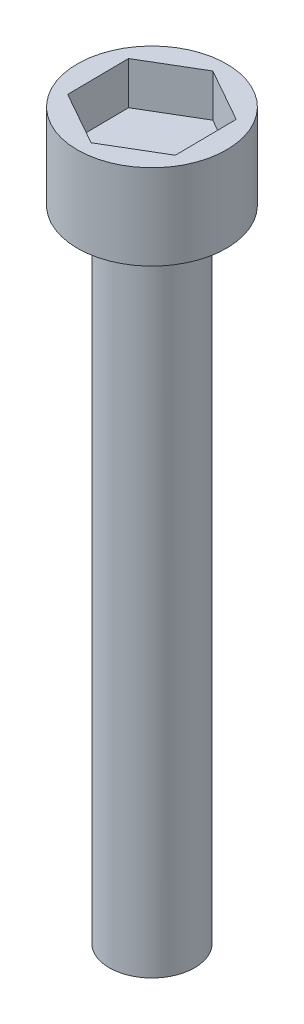
ISO-10303-21;
HEADER;
FILE_DESCRIPTION(('STEP AP214'),'2;1');
FILE_NAME('part.step','',(''),(''),'','','');
FILE_SCHEMA(('AUTOMOTIVE_DESIGN { 1 0 10303 214 1 1 1 1 }'));
ENDSEC;
DATA;
#1=APPLICATION_CONTEXT('core data for automotive mechanical design processes');
#2=APPLICATION_PROTOCOL_DEFINITION('international standard','automotive_design',2000,#1);
#3=PRODUCT_CONTEXT('',#1,'mechanical');
#4=PRODUCT('Part','Part','',(#3));
#5=PRODUCT_RELATED_PRODUCT_CATEGORY('part','',(#4));
#6=PRODUCT_DEFINITION_FORMATION('','',#4);
#7=PRODUCT_DEFINITION_CONTEXT('part definition',#1,'design');
#8=PRODUCT_DEFINITION('design','',#6,#7);
#9=PRODUCT_DEFINITION_SHAPE('','',#8);
#10=(LENGTH_UNIT() NAMED_UNIT(*) SI_UNIT(.MILLI.,.METRE.));
#11=(NAMED_UNIT(*) PLANE_ANGLE_UNIT() SI_UNIT($,.RADIAN.));
#12=(NAMED_UNIT(*) SI_UNIT($,.STERADIAN.) SOLID_ANGLE_UNIT());
#13=UNCERTAINTY_MEASURE_WITH_UNIT(LENGTH_MEASURE(1.E-05),#10,'distance_accuracy_value','');
#14=(GEOMETRIC_REPRESENTATION_CONTEXT(3) GLOBAL_UNCERTAINTY_ASSIGNED_CONTEXT((#13)) GLOBAL_UNIT_ASSIGNED_CONTEXT((#10,
#11,#12)) REPRESENTATION_CONTEXT('',''));
#15=CARTESIAN_POINT('',(0.,0.,0.));
#16=DIRECTION('',(0.,0.,1.));
#17=DIRECTION('',(1.,0.,0.));
#18=AXIS2_PLACEMENT_3D('',#15,#16,#17);
#19=CARTESIAN_POINT('',(0.,-4.,0.));
#20=DIRECTION('',(0.,1.,0.));
#21=DIRECTION('',(0.,0.,1.));
#22=AXIS2_PLACEMENT_3D('',#19,#20,#21);
#23=CYLINDRICAL_SURFACE('',#22,3.5);
#24=CARTESIAN_POINT('',(0.,-4.,0.));
#25=DIRECTION('',(0.,1.,0.));
#26=DIRECTION('',(0.,0.,1.));
#27=AXIS2_PLACEMENT_3D('',#24,#25,#26);
#28=CIRCLE('',#27,3.5);
#29=CARTESIAN_POINT('',(0.,-4.,3.5));
#30=VERTEX_POINT('',#29);
#31=EDGE_CURVE('E41',#30,#30,#28,.T.);
#32=ORIENTED_EDGE('',*,*,#31,.T.);
#33=EDGE_LOOP('',(#32));
#34=FACE_BOUND('',#33,.T.);
#35=CARTESIAN_POINT('',(0.,0.,0.));
#36=DIRECTION('',(0.,1.,0.));
#37=DIRECTION('',(0.,0.,1.));
#38=AXIS2_PLACEMENT_3D('',#35,#36,#37);
#39=CIRCLE('',#38,3.5);
#40=CARTESIAN_POINT('',(0.,0.,3.5));
#41=VERTEX_POINT('',#40);
#42=EDGE_CURVE('E143',#41,#41,#39,.T.);
#43=ORIENTED_EDGE('',*,*,#42,.F.);
#44=EDGE_LOOP('',(#43));
#45=FACE_BOUND('',#44,.T.);
#46=ADVANCED_FACE('F34',(#34,#45),#23,.T.);
#47=CARTESIAN_POINT('',(0.,-4.,0.));
#48=DIRECTION('',(0.,1.,0.));
#49=DIRECTION('',(0.,0.,1.));
#50=AXIS2_PLACEMENT_3D('',#47,#48,#49);
#51=PLANE('',#50);
#52=CARTESIAN_POINT('',(0.,-4.,0.));
#53=DIRECTION('',(0.,1.,0.));
#54=DIRECTION('',(0.,0.,1.));
#55=AXIS2_PLACEMENT_3D('',#52,#53,#54);
#56=CIRCLE('',#55,2.);
#57=CARTESIAN_POINT('',(0.,-4.,2.));
#58=VERTEX_POINT('',#57);
#59=EDGE_CURVE('E11',#58,#58,#56,.F.);
#60=ORIENTED_EDGE('',*,*,#59,.F.);
#61=EDGE_LOOP('',(#60));
#62=FACE_BOUND('',#61,.T.);
#63=ORIENTED_EDGE('',*,*,#31,.F.);
#64=EDGE_LOOP('',(#63));
#65=FACE_BOUND('',#64,.T.);
#66=ADVANCED_FACE('F151',(#62,#65),#51,.F.);
#67=CARTESIAN_POINT('',(0.,0.,0.));
#68=DIRECTION('',(0.,1.,0.));
#69=DIRECTION('',(0.,0.,1.));
#70=AXIS2_PLACEMENT_3D('',#67,#68,#69);
#71=PLANE('',#70);
#72=DIRECTION('',(-0.0108771505972784,0.,-0.99994084204761));
#73=VECTOR('',#72,1.);
#74=CARTESIAN_POINT('',(2.51555191968241,0.,1.41609740933153));
#75=LINE('',#74,#73);
#76=CARTESIAN_POINT('',(2.51555191968241,0.,1.41609740933153));
#77=VERTEX_POINT('',#76);
#78=CARTESIAN_POINT('',(2.48415229055564,0.,-1.47048316231792));
#79=VERTEX_POINT('',#78);
#80=EDGE_CURVE('E48',#77,#79,#75,.T.);
#81=ORIENTED_EDGE('',*,*,#80,.F.);
#82=DIRECTION('',(0.860535596196194,0.,-0.509390309761838));
#83=VECTOR('',#82,1.);
#84=CARTESIAN_POINT('',(0.031399629126774,0.,2.88658057164945));
#85=LINE('',#84,#83);
#86=CARTESIAN_POINT('',(0.031399629126774,0.,2.88658057164945));
#87=VERTEX_POINT('',#86);
#88=EDGE_CURVE('E131',#87,#77,#85,.T.);
#89=ORIENTED_EDGE('',*,*,#88,.F.);
#90=DIRECTION('',(0.871412746793473,0.,0.490550532285773));
#91=VECTOR('',#90,1.);
#92=CARTESIAN_POINT('',(-2.48415229055564,0.,1.47048316231792));
#93=LINE('',#92,#91);
#94=CARTESIAN_POINT('',(-2.48415229055564,0.,1.47048316231792));
#95=VERTEX_POINT('',#94);
#96=EDGE_CURVE('E129',#95,#87,#93,.T.);
#97=ORIENTED_EDGE('',*,*,#96,.F.);
#98=DIRECTION('',(0.0108771505972782,0.,0.99994084204761));
#99=VECTOR('',#98,1.);
#100=CARTESIAN_POINT('',(-2.51555191968241,0.,-1.41609740933153));
#101=LINE('',#100,#99);
#102=CARTESIAN_POINT('',(-2.51555191968241,0.,-1.41609740933153));
#103=VERTEX_POINT('',#102);
#104=EDGE_CURVE('E96',#103,#95,#101,.T.);
#105=ORIENTED_EDGE('',*,*,#104,.F.);
#106=DIRECTION('',(-0.860535596196194,0.,0.509390309761837));
#107=VECTOR('',#106,1.);
#108=CARTESIAN_POINT('',(-0.031399629126774,0.,-2.88658057164945));
#109=LINE('',#108,#107);
#110=CARTESIAN_POINT('',(-0.031399629126774,0.,-2.88658057164945));
#111=VERTEX_POINT('',#110);
#112=EDGE_CURVE('E125',#111,#103,#109,.T.);
#113=ORIENTED_EDGE('',*,*,#112,.F.);
#114=DIRECTION('',(-0.871412746793473,0.,-0.490550532285773));
#115=VECTOR('',#114,1.);
#116=CARTESIAN_POINT('',(2.48415229055564,0.,-1.47048316231792));
#117=LINE('',#116,#115);
#118=EDGE_CURVE('E122',#79,#111,#117,.T.);
#119=ORIENTED_EDGE('',*,*,#118,.F.);
#120=EDGE_LOOP('',(#81,#89,#97,#105,#113,#119));
#121=FACE_BOUND('',#120,.T.);
#122=ORIENTED_EDGE('',*,*,#42,.T.);
#123=EDGE_LOOP('',(#122));
#124=FACE_BOUND('',#123,.T.);
#125=ADVANCED_FACE('F148',(#121,#124),#71,.T.);
#126=CARTESIAN_POINT('',(0.,-34.,0.));
#127=DIRECTION('',(0.,1.,0.));
#128=DIRECTION('',(0.,0.,1.));
#129=AXIS2_PLACEMENT_3D('',#126,#127,#128);
#130=CYLINDRICAL_SURFACE('',#129,2.);
#131=CARTESIAN_POINT('',(0.,-34.,0.));
#132=DIRECTION('',(0.,-1.,0.));
#133=DIRECTION('',(0.,0.,-1.));
#134=AXIS2_PLACEMENT_3D('',#131,#132,#133);
#135=CIRCLE('',#134,2.);
#136=CARTESIAN_POINT('',(0.,-34.,-2.));
#137=VERTEX_POINT('',#136);
#138=EDGE_CURVE('E135',#137,#137,#135,.T.);
#139=ORIENTED_EDGE('',*,*,#138,.F.);
#140=EDGE_LOOP('',(#139));
#141=FACE_BOUND('',#140,.T.);
#142=ORIENTED_EDGE('',*,*,#59,.T.);
#143=EDGE_LOOP('',(#142));
#144=FACE_BOUND('',#143,.T.);
#145=ADVANCED_FACE('F163',(#141,#144),#130,.T.);
#146=CARTESIAN_POINT('',(0.,-34.,0.));
#147=DIRECTION('',(0.,-1.,0.));
#148=DIRECTION('',(0.,0.,-1.));
#149=AXIS2_PLACEMENT_3D('',#146,#147,#148);
#150=PLANE('',#149);
#151=ORIENTED_EDGE('',*,*,#138,.T.);
#152=EDGE_LOOP('',(#151));
#153=FACE_BOUND('',#152,.T.);
#154=ADVANCED_FACE('F169',(#153),#150,.T.);
#155=CARTESIAN_POINT('',(2.51555191968241,-2.,1.41609740933153));
#156=DIRECTION('',(0.99994084204761,0.,-0.0108771505972784));
#157=DIRECTION('',(-0.0108771505972784,0.,-0.999940842047611));
#158=AXIS2_PLACEMENT_3D('',#155,#156,#157);
#159=PLANE('',#158);
#160=ORIENTED_EDGE('',*,*,#80,.T.);
#161=DIRECTION('',(0.,1.,0.));
#162=VECTOR('',#161,1.);
#163=CARTESIAN_POINT('',(2.48415229055564,-2.,-1.47048316231792));
#164=LINE('',#163,#162);
#165=CARTESIAN_POINT('',(2.48415229055564,-2.,-1.47048316231792));
#166=VERTEX_POINT('',#165);
#167=EDGE_CURVE('E78',#166,#79,#164,.T.);
#168=ORIENTED_EDGE('',*,*,#167,.F.);
#169=DIRECTION('',(-0.0108771505972784,0.,-0.99994084204761));
#170=VECTOR('',#169,1.);
#171=CARTESIAN_POINT('',(2.51555191968241,-2.,1.41609740933153));
#172=LINE('',#171,#170);
#173=CARTESIAN_POINT('',(2.51555191968241,-2.,1.41609740933153));
#174=VERTEX_POINT('',#173);
#175=EDGE_CURVE('E133',#174,#166,#172,.T.);
#176=ORIENTED_EDGE('',*,*,#175,.F.);
#177=DIRECTION('',(0.,1.,0.));
#178=VECTOR('',#177,1.);
#179=CARTESIAN_POINT('',(2.51555191968241,-2.,1.41609740933153));
#180=LINE('',#179,#178);
#181=EDGE_CURVE('E56',#174,#77,#180,.T.);
#182=ORIENTED_EDGE('',*,*,#181,.T.);
#183=EDGE_LOOP('',(#160,#168,#176,#182));
#184=FACE_BOUND('',#183,.T.);
#185=ADVANCED_FACE('F173',(#184),#159,.F.);
#186=CARTESIAN_POINT('',(0.031399629126774,-2.,2.88658057164945));
#187=DIRECTION('',(0.509390309761838,0.,0.860535596196194));
#188=DIRECTION('',(0.860535596196194,0.,-0.509390309761838));
#189=AXIS2_PLACEMENT_3D('',#186,#187,#188);
#190=PLANE('',#189);
#191=ORIENTED_EDGE('',*,*,#88,.T.);
#192=ORIENTED_EDGE('',*,*,#181,.F.);
#193=DIRECTION('',(0.860535596196194,0.,-0.509390309761838));
#194=VECTOR('',#193,1.);
#195=CARTESIAN_POINT('',(0.031399629126774,-2.,2.88658057164945));
#196=LINE('',#195,#194);
#197=CARTESIAN_POINT('',(0.031399629126774,-2.,2.88658057164945));
#198=VERTEX_POINT('',#197);
#199=EDGE_CURVE('E108',#198,#174,#196,.T.);
#200=ORIENTED_EDGE('',*,*,#199,.F.);
#201=DIRECTION('',(0.,1.,0.));
#202=VECTOR('',#201,1.);
#203=CARTESIAN_POINT('',(0.031399629126774,-2.,2.88658057164945));
#204=LINE('',#203,#202);
#205=EDGE_CURVE('E100',#198,#87,#204,.T.);
#206=ORIENTED_EDGE('',*,*,#205,.T.);
#207=EDGE_LOOP('',(#191,#192,#200,#206));
#208=FACE_BOUND('',#207,.T.);
#209=ADVANCED_FACE('F177',(#208),#190,.F.);
#210=CARTESIAN_POINT('',(-2.48415229055564,-2.,1.47048316231792));
#211=DIRECTION('',(-0.490550532285773,0.,0.871412746793473));
#212=DIRECTION('',(0.871412746793473,0.,0.490550532285773));
#213=AXIS2_PLACEMENT_3D('',#210,#211,#212);
#214=PLANE('',#213);
#215=ORIENTED_EDGE('',*,*,#96,.T.);
#216=ORIENTED_EDGE('',*,*,#205,.F.);
#217=DIRECTION('',(0.871412746793473,0.,0.490550532285773));
#218=VECTOR('',#217,1.);
#219=CARTESIAN_POINT('',(-2.48415229055564,-2.,1.47048316231792));
#220=LINE('',#219,#218);
#221=CARTESIAN_POINT('',(-2.48415229055564,-2.,1.47048316231792));
#222=VERTEX_POINT('',#221);
#223=EDGE_CURVE('E104',#222,#198,#220,.T.);
#224=ORIENTED_EDGE('',*,*,#223,.F.);
#225=DIRECTION('',(0.,1.,0.));
#226=VECTOR('',#225,1.);
#227=CARTESIAN_POINT('',(-2.48415229055564,-2.,1.47048316231792));
#228=LINE('',#227,#226);
#229=EDGE_CURVE('E89',#222,#95,#228,.T.);
#230=ORIENTED_EDGE('',*,*,#229,.T.);
#231=EDGE_LOOP('',(#215,#216,#224,#230));
#232=FACE_BOUND('',#231,.T.);
#233=ADVANCED_FACE('F105',(#232),#214,.F.);
#234=CARTESIAN_POINT('',(-2.51555191968241,-2.,-1.41609740933153));
#235=DIRECTION('',(-0.99994084204761,0.,0.0108771505972782));
#236=DIRECTION('',(0.0108771505972782,0.,0.999940842047611));
#237=AXIS2_PLACEMENT_3D('',#234,#235,#236);
#238=PLANE('',#237);
#239=ORIENTED_EDGE('',*,*,#104,.T.);
#240=ORIENTED_EDGE('',*,*,#229,.F.);
#241=DIRECTION('',(0.0108771505972782,0.,0.99994084204761));
#242=VECTOR('',#241,1.);
#243=CARTESIAN_POINT('',(-2.51555191968241,-2.,-1.41609740933153));
#244=LINE('',#243,#242);
#245=CARTESIAN_POINT('',(-2.51555191968241,-2.,-1.41609740933153));
#246=VERTEX_POINT('',#245);
#247=EDGE_CURVE('E93',#246,#222,#244,.T.);
#248=ORIENTED_EDGE('',*,*,#247,.F.);
#249=DIRECTION('',(0.,1.,0.));
#250=VECTOR('',#249,1.);
#251=CARTESIAN_POINT('',(-2.51555191968241,-2.,-1.41609740933153));
#252=LINE('',#251,#250);
#253=EDGE_CURVE('E101',#246,#103,#252,.T.);
#254=ORIENTED_EDGE('',*,*,#253,.T.);
#255=EDGE_LOOP('',(#239,#240,#248,#254));
#256=FACE_BOUND('',#255,.T.);
#257=ADVANCED_FACE('F91',(#256),#238,.F.);
#258=CARTESIAN_POINT('',(-0.031399629126774,-2.,-2.88658057164945));
#259=DIRECTION('',(-0.509390309761837,0.,-0.860535596196194));
#260=DIRECTION('',(-0.860535596196194,0.,0.509390309761837));
#261=AXIS2_PLACEMENT_3D('',#258,#259,#260);
#262=PLANE('',#261);
#263=ORIENTED_EDGE('',*,*,#112,.T.);
#264=ORIENTED_EDGE('',*,*,#253,.F.);
#265=DIRECTION('',(-0.860535596196194,0.,0.509390309761837));
#266=VECTOR('',#265,1.);
#267=CARTESIAN_POINT('',(-0.031399629126774,-2.,-2.88658057164945));
#268=LINE('',#267,#266);
#269=CARTESIAN_POINT('',(-0.031399629126774,-2.,-2.88658057164945));
#270=VERTEX_POINT('',#269);
#271=EDGE_CURVE('E114',#270,#246,#268,.T.);
#272=ORIENTED_EDGE('',*,*,#271,.F.);
#273=DIRECTION('',(0.,1.,0.));
#274=VECTOR('',#273,1.);
#275=CARTESIAN_POINT('',(-0.031399629126774,-2.,-2.88658057164945));
#276=LINE('',#275,#274);
#277=EDGE_CURVE('E138',#270,#111,#276,.T.);
#278=ORIENTED_EDGE('',*,*,#277,.T.);
#279=EDGE_LOOP('',(#263,#264,#272,#278));
#280=FACE_BOUND('',#279,.T.);
#281=ADVANCED_FACE('F181',(#280),#262,.F.);
#282=CARTESIAN_POINT('',(2.48415229055564,-2.,-1.47048316231792));
#283=DIRECTION('',(0.490550532285773,0.,-0.871412746793473));
#284=DIRECTION('',(-0.871412746793473,0.,-0.490550532285773));
#285=AXIS2_PLACEMENT_3D('',#282,#283,#284);
#286=PLANE('',#285);
#287=ORIENTED_EDGE('',*,*,#118,.T.);
#288=ORIENTED_EDGE('',*,*,#277,.F.);
#289=DIRECTION('',(-0.871412746793473,0.,-0.490550532285773));
#290=VECTOR('',#289,1.);
#291=CARTESIAN_POINT('',(2.48415229055564,-2.,-1.47048316231792));
#292=LINE('',#291,#290);
#293=EDGE_CURVE('E116',#166,#270,#292,.T.);
#294=ORIENTED_EDGE('',*,*,#293,.F.);
#295=ORIENTED_EDGE('',*,*,#167,.T.);
#296=EDGE_LOOP('',(#287,#288,#294,#295));
#297=FACE_BOUND('',#296,.T.);
#298=ADVANCED_FACE('F178',(#297),#286,.F.);
#299=CARTESIAN_POINT('',(0.,-2.,0.));
#300=DIRECTION('',(0.,1.,0.));
#301=DIRECTION('',(0.,0.,1.));
#302=AXIS2_PLACEMENT_3D('',#299,#300,#301);
#303=PLANE('',#302);
#304=ORIENTED_EDGE('',*,*,#175,.T.);
#305=ORIENTED_EDGE('',*,*,#293,.T.);
#306=ORIENTED_EDGE('',*,*,#271,.T.);
#307=ORIENTED_EDGE('',*,*,#247,.T.);
#308=ORIENTED_EDGE('',*,*,#223,.T.);
#309=ORIENTED_EDGE('',*,*,#199,.T.);
#310=EDGE_LOOP('',(#304,#305,#306,#307,#308,#309));
#311=FACE_BOUND('',#310,.T.);
#312=ADVANCED_FACE('F111',(#311),#303,.T.);
#313=CLOSED_SHELL('',(#46,#66,#125,#145,#154,#185,#209,#233,#257,#281,#298,#312));
#314=MANIFOLD_SOLID_BREP('B2',#313);
#315=ADVANCED_BREP_SHAPE_REPRESENTATION('',(#18,#314),#14);
#316=SHAPE_DEFINITION_REPRESENTATION(#9,#315);
ENDSEC;
END-ISO-10303-21;
